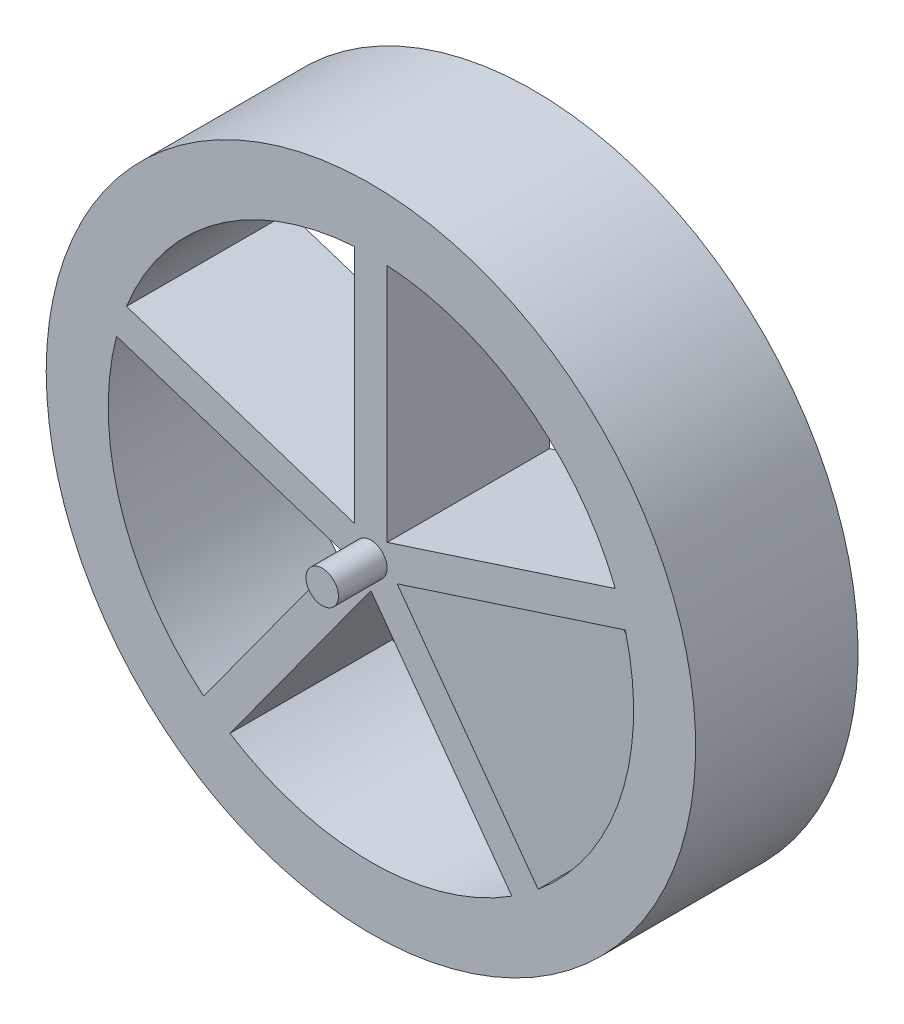
ISO-10303-21;
HEADER;
FILE_DESCRIPTION(('STEP AP214'),'2;1');
FILE_NAME('part.step','',(''),(''),'','','');
FILE_SCHEMA(('AUTOMOTIVE_DESIGN { 1 0 10303 214 1 1 1 1 }'));
ENDSEC;
DATA;
#1=APPLICATION_CONTEXT('core data for automotive mechanical design processes');
#2=APPLICATION_PROTOCOL_DEFINITION('international standard','automotive_design',2000,#1);
#3=PRODUCT_CONTEXT('',#1,'mechanical');
#4=PRODUCT('Part','Part','',(#3));
#5=PRODUCT_RELATED_PRODUCT_CATEGORY('part','',(#4));
#6=PRODUCT_DEFINITION_FORMATION('','',#4);
#7=PRODUCT_DEFINITION_CONTEXT('part definition',#1,'design');
#8=PRODUCT_DEFINITION('design','',#6,#7);
#9=PRODUCT_DEFINITION_SHAPE('','',#8);
#10=(LENGTH_UNIT() NAMED_UNIT(*) SI_UNIT(.MILLI.,.METRE.));
#11=(NAMED_UNIT(*) PLANE_ANGLE_UNIT() SI_UNIT($,.RADIAN.));
#12=(NAMED_UNIT(*) SI_UNIT($,.STERADIAN.) SOLID_ANGLE_UNIT());
#13=UNCERTAINTY_MEASURE_WITH_UNIT(LENGTH_MEASURE(1.E-05),#10,'distance_accuracy_value','');
#14=(GEOMETRIC_REPRESENTATION_CONTEXT(3) GLOBAL_UNCERTAINTY_ASSIGNED_CONTEXT((#13)) GLOBAL_UNIT_ASSIGNED_CONTEXT((#10,
#11,#12)) REPRESENTATION_CONTEXT('',''));
#15=CARTESIAN_POINT('',(0.,0.,0.));
#16=DIRECTION('',(0.,0.,1.));
#17=DIRECTION('',(1.,0.,0.));
#18=AXIS2_PLACEMENT_3D('',#15,#16,#17);
#19=CARTESIAN_POINT('',(0.,0.,40.));
#20=DIRECTION('',(0.,0.,1.));
#21=DIRECTION('',(1.,0.,0.));
#22=AXIS2_PLACEMENT_3D('',#19,#20,#21);
#23=PLANE('',#22);
#24=CARTESIAN_POINT('',(0.,0.,40.));
#25=DIRECTION('',(0.,0.,-1.));
#26=DIRECTION('',(-1.,0.,0.));
#27=AXIS2_PLACEMENT_3D('',#24,#25,#26);
#28=CIRCLE('',#27,5.);
#29=CARTESIAN_POINT('',(-5.,0.,40.));
#30=VERTEX_POINT('',#29);
#31=EDGE_CURVE('E20',#30,#30,#28,.T.);
#32=ORIENTED_EDGE('',*,*,#31,.F.);
#33=EDGE_LOOP('',(#32));
#34=FACE_BOUND('',#33,.T.);
#35=ADVANCED_FACE('F17',(#34),#23,.T.);
#36=CARTESIAN_POINT('',(0.,0.,40.));
#37=DIRECTION('',(0.,0.,-1.));
#38=DIRECTION('',(-1.,0.,0.));
#39=AXIS2_PLACEMENT_3D('',#36,#37,#38);
#40=CYLINDRICAL_SURFACE('',#39,5.);
#41=ORIENTED_EDGE('',*,*,#31,.T.);
#42=EDGE_LOOP('',(#41));
#43=FACE_BOUND('',#42,.T.);
#44=CARTESIAN_POINT('',(0.,0.,25.));
#45=DIRECTION('',(0.,0.,-1.));
#46=DIRECTION('',(-1.,0.,0.));
#47=AXIS2_PLACEMENT_3D('',#44,#45,#46);
#48=CIRCLE('',#47,5.);
#49=CARTESIAN_POINT('',(-5.,0.,25.));
#50=VERTEX_POINT('',#49);
#51=EDGE_CURVE('E158',#50,#50,#48,.T.);
#52=ORIENTED_EDGE('',*,*,#51,.F.);
#53=EDGE_LOOP('',(#52));
#54=FACE_BOUND('',#53,.T.);
#55=ADVANCED_FACE('F379',(#43,#54),#40,.T.);
#56=CARTESIAN_POINT('',(35.9753398201831,-41.0191694885095,25.));
#57=DIRECTION('',(0.809016994374947,0.587785252292474,0.));
#58=DIRECTION('',(-0.587785252292474,0.809016994374947,0.));
#59=AXIS2_PLACEMENT_3D('',#56,#57,#58);
#60=PLANE('',#59);
#61=DIRECTION('',(-0.587785252292473,0.809016994374947,0.));
#62=VECTOR('',#61,1.);
#63=CARTESIAN_POINT('',(51.5025235293377,-62.3905044216244,-25.));
#64=LINE('',#63,#62);
#65=CARTESIAN_POINT('',(51.5025235293377,-62.3905044216244,-25.));
#66=VERTEX_POINT('',#65);
#67=CARTESIAN_POINT('',(8.08436835006003,-2.63054061265489,-25.));
#68=VERTEX_POINT('',#67);
#69=EDGE_CURVE('E161',#66,#68,#64,.T.);
#70=ORIENTED_EDGE('',*,*,#69,.T.);
#71=DIRECTION('',(0.,0.,1.));
#72=VECTOR('',#71,1.);
#73=CARTESIAN_POINT('',(8.08436835006002,-2.63054061265489,25.));
#74=LINE('',#73,#72);
#75=CARTESIAN_POINT('',(8.08436835006002,-2.63054061265488,25.));
#76=VERTEX_POINT('',#75);
#77=EDGE_CURVE('E112',#76,#68,#74,.F.);
#78=ORIENTED_EDGE('',*,*,#77,.F.);
#79=DIRECTION('',(-0.587785252292473,0.809016994374948,0.));
#80=VECTOR('',#79,1.);
#81=CARTESIAN_POINT('',(51.5025235293376,-62.3905044216245,25.));
#82=LINE('',#81,#80);
#83=CARTESIAN_POINT('',(51.5025235293377,-62.3905044216245,25.));
#84=VERTEX_POINT('',#83);
#85=EDGE_CURVE('E114',#84,#76,#82,.T.);
#86=ORIENTED_EDGE('',*,*,#85,.F.);
#87=DIRECTION('',(0.,0.,-1.));
#88=VECTOR('',#87,1.);
#89=CARTESIAN_POINT('',(51.5025235293377,-62.3905044216244,25.));
#90=LINE('',#89,#88);
#91=EDGE_CURVE('E117',#84,#66,#90,.T.);
#92=ORIENTED_EDGE('',*,*,#91,.T.);
#93=EDGE_LOOP('',(#70,#78,#86,#92));
#94=FACE_BOUND('',#93,.T.);
#95=ADVANCED_FACE('F116',(#94),#60,.T.);
#96=CARTESIAN_POINT('',(23.9130078857885,2.51249613707417,25.));
#97=DIRECTION('',(0.309016994374948,-0.951056516295154,0.));
#98=DIRECTION('',(0.951056516295154,0.309016994374948,0.));
#99=AXIS2_PLACEMENT_3D('',#96,#97,#98);
#100=PLANE('',#99);
#101=DIRECTION('',(0.951056516295153,0.309016994374949,0.));
#102=VECTOR('',#101,1.);
#103=CARTESIAN_POINT('',(8.08436835006002,-2.63054061265488,-25.));
#104=LINE('',#103,#102);
#105=CARTESIAN_POINT('',(78.340086498309,20.196925986699,-25.));
#106=VERTEX_POINT('',#105);
#107=EDGE_CURVE('E164',#68,#106,#104,.T.);
#108=ORIENTED_EDGE('',*,*,#107,.T.);
#109=DIRECTION('',(0.,0.,-1.));
#110=VECTOR('',#109,1.);
#111=CARTESIAN_POINT('',(78.340086498309,20.196925986699,25.));
#112=LINE('',#111,#110);
#113=CARTESIAN_POINT('',(78.340086498309,20.196925986699,25.));
#114=VERTEX_POINT('',#113);
#115=EDGE_CURVE('E105',#106,#114,#112,.F.);
#116=ORIENTED_EDGE('',*,*,#115,.T.);
#117=DIRECTION('',(0.951056516295153,0.309016994374949,0.));
#118=VECTOR('',#117,1.);
#119=CARTESIAN_POINT('',(8.08436835006003,-2.63054061265488,25.));
#120=LINE('',#119,#118);
#121=EDGE_CURVE('E122',#76,#114,#120,.T.);
#122=ORIENTED_EDGE('',*,*,#121,.F.);
#123=ORIENTED_EDGE('',*,*,#77,.T.);
#124=EDGE_LOOP('',(#108,#116,#122,#123));
#125=FACE_BOUND('',#124,.T.);
#126=ADVANCED_FACE('F318',(#125),#100,.T.);
#127=CARTESIAN_POINT('',(3.41264393947058E-13,0.,25.));
#128=DIRECTION('',(0.,0.,-1.));
#129=DIRECTION('',(-1.,0.,0.));
#130=AXIS2_PLACEMENT_3D('',#127,#128,#129);
#131=CYLINDRICAL_SURFACE('',#130,80.9016994374944);
#132=CARTESIAN_POINT('',(3.41264393947058E-13,0.,25.));
#133=DIRECTION('',(0.,0.,-1.));
#134=DIRECTION('',(-1.,0.,0.));
#135=AXIS2_PLACEMENT_3D('',#132,#133,#134);
#136=CIRCLE('',#135,80.9016994374944);
#137=EDGE_CURVE('E127',#114,#84,#136,.T.);
#138=ORIENTED_EDGE('',*,*,#137,.F.);
#139=ORIENTED_EDGE('',*,*,#115,.F.);
#140=CARTESIAN_POINT('',(3.41264393947058E-13,0.,-25.));
#141=DIRECTION('',(0.,0.,-1.));
#142=DIRECTION('',(-1.,0.,0.));
#143=AXIS2_PLACEMENT_3D('',#140,#141,#142);
#144=CIRCLE('',#143,80.9016994374944);
#145=EDGE_CURVE('E129',#106,#66,#144,.T.);
#146=ORIENTED_EDGE('',*,*,#145,.T.);
#147=ORIENTED_EDGE('',*,*,#91,.F.);
#148=EDGE_LOOP('',(#138,#139,#146,#147));
#149=FACE_BOUND('',#148,.T.);
#150=ADVANCED_FACE('F126',(#149),#131,.F.);
#151=CARTESIAN_POINT('',(-5.00000000000005,55.5819738354776,25.));
#152=DIRECTION('',(-1.,0.,0.));
#153=DIRECTION('',(0.,-1.,0.));
#154=AXIS2_PLACEMENT_3D('',#151,#152,#153);
#155=PLANE('',#154);
#156=DIRECTION('',(0.,1.,0.));
#157=VECTOR('',#156,1.);
#158=CARTESIAN_POINT('',(-5.00000000000005,0.,-25.));
#159=LINE('',#158,#157);
#160=CARTESIAN_POINT('',(-5.00000000000007,80.7470431153658,-25.));
#161=VERTEX_POINT('',#160);
#162=CARTESIAN_POINT('',(-5.00000000000007,6.88190960235584,-25.));
#163=VERTEX_POINT('',#162);
#164=EDGE_CURVE('E163',#161,#163,#159,.F.);
#165=ORIENTED_EDGE('',*,*,#164,.T.);
#166=DIRECTION('',(0.,0.,1.));
#167=VECTOR('',#166,1.);
#168=CARTESIAN_POINT('',(-5.0000000000001,6.88190960235586,25.));
#169=LINE('',#168,#167);
#170=CARTESIAN_POINT('',(-5.00000000000009,6.88190960235585,25.));
#171=VERTEX_POINT('',#170);
#172=EDGE_CURVE('E131',#171,#163,#169,.F.);
#173=ORIENTED_EDGE('',*,*,#172,.F.);
#174=DIRECTION('',(0.,1.,0.));
#175=VECTOR('',#174,1.);
#176=CARTESIAN_POINT('',(-5.00000000000009,0.,25.));
#177=LINE('',#176,#175);
#178=CARTESIAN_POINT('',(-5.00000000000009,80.7470431153658,25.));
#179=VERTEX_POINT('',#178);
#180=EDGE_CURVE('E143',#179,#171,#177,.F.);
#181=ORIENTED_EDGE('',*,*,#180,.F.);
#182=DIRECTION('',(0.,0.,-1.));
#183=VECTOR('',#182,1.);
#184=CARTESIAN_POINT('',(-5.0000000000001,80.7470431153658,25.));
#185=LINE('',#184,#183);
#186=EDGE_CURVE('E191',#179,#161,#185,.T.);
#187=ORIENTED_EDGE('',*,*,#186,.T.);
#188=EDGE_LOOP('',(#165,#173,#181,#187));
#189=FACE_BOUND('',#188,.T.);
#190=ADVANCED_FACE('F369',(#189),#155,.T.);
#191=CARTESIAN_POINT('',(-17.7704285840007,11.0312733786334,25.));
#192=DIRECTION('',(0.309016994374947,0.951056516295154,0.));
#193=DIRECTION('',(-0.951056516295154,0.309016994374947,0.));
#194=AXIS2_PLACEMENT_3D('',#191,#192,#193);
#195=PLANE('',#194);
#196=DIRECTION('',(-0.951056516295154,0.309016994374948,0.));
#197=VECTOR('',#196,1.);
#198=CARTESIAN_POINT('',(-5.00000000000005,6.88190960235583,-25.));
#199=LINE('',#198,#197);
#200=CARTESIAN_POINT('',(-75.2499165545596,29.7074911496503,-25.));
#201=VERTEX_POINT('',#200);
#202=EDGE_CURVE('E169',#163,#201,#199,.T.);
#203=ORIENTED_EDGE('',*,*,#202,.T.);
#204=DIRECTION('',(0.,0.,-1.));
#205=VECTOR('',#204,1.);
#206=CARTESIAN_POINT('',(-75.2499165545596,29.7074911496503,25.));
#207=LINE('',#206,#205);
#208=CARTESIAN_POINT('',(-75.2499165545596,29.7074911496504,25.));
#209=VERTEX_POINT('',#208);
#210=EDGE_CURVE('E192',#201,#209,#207,.F.);
#211=ORIENTED_EDGE('',*,*,#210,.T.);
#212=DIRECTION('',(-0.951056516295154,0.309016994374948,0.));
#213=VECTOR('',#212,1.);
#214=CARTESIAN_POINT('',(-5.0000000000001,6.88190960235585,25.));
#215=LINE('',#214,#213);
#216=EDGE_CURVE('E148',#171,#209,#215,.T.);
#217=ORIENTED_EDGE('',*,*,#216,.F.);
#218=ORIENTED_EDGE('',*,*,#172,.T.);
#219=EDGE_LOOP('',(#203,#211,#217,#218));
#220=FACE_BOUND('',#219,.T.);
#221=ADVANCED_FACE('F365',(#220),#195,.T.);
#222=CARTESIAN_POINT('',(0.,0.,25.));
#223=DIRECTION('',(0.,0.,-1.));
#224=DIRECTION('',(-1.,0.,0.));
#225=AXIS2_PLACEMENT_3D('',#222,#223,#224);
#226=CYLINDRICAL_SURFACE('',#225,80.9016994374948);
#227=ORIENTED_EDGE('',*,*,#210,.F.);
#228=CARTESIAN_POINT('',(0.,0.,-25.));
#229=DIRECTION('',(0.,0.,-1.));
#230=DIRECTION('',(-1.,0.,0.));
#231=AXIS2_PLACEMENT_3D('',#228,#229,#230);
#232=CIRCLE('',#231,80.9016994374948);
#233=EDGE_CURVE('E165',#201,#161,#232,.T.);
#234=ORIENTED_EDGE('',*,*,#233,.T.);
#235=ORIENTED_EDGE('',*,*,#186,.F.);
#236=CARTESIAN_POINT('',(0.,0.,25.));
#237=DIRECTION('',(0.,0.,-1.));
#238=DIRECTION('',(-1.,0.,0.));
#239=AXIS2_PLACEMENT_3D('',#236,#237,#238);
#240=CIRCLE('',#239,80.9016994374948);
#241=EDGE_CURVE('E144',#209,#179,#240,.T.);
#242=ORIENTED_EDGE('',*,*,#241,.F.);
#243=EDGE_LOOP('',(#227,#234,#235,#242));
#244=FACE_BOUND('',#243,.T.);
#245=ADVANCED_FACE('F361',(#244),#226,.F.);
#246=CARTESIAN_POINT('',(-20.7622587651239,-20.0702895089404,25.));
#247=DIRECTION('',(-0.809016994374948,0.587785252292473,0.));
#248=DIRECTION('',(-0.587785252292473,-0.809016994374948,0.));
#249=AXIS2_PLACEMENT_3D('',#246,#247,#248);
#250=PLANE('',#249);
#251=DIRECTION('',(-0.587785252292473,-0.809016994374948,0.));
#252=VECTOR('',#251,1.);
#253=CARTESIAN_POINT('',(-8.09016994374947,-2.62865556059569,-25.));
#254=LINE('',#253,#252);
#255=CARTESIAN_POINT('',(-8.09016994374947,-2.62865556059569,-25.));
#256=VERTEX_POINT('',#255);
#257=CARTESIAN_POINT('',(-51.5070060813112,-62.3868038643952,-25.));
#258=VERTEX_POINT('',#257);
#259=EDGE_CURVE('E168',#256,#258,#254,.T.);
#260=ORIENTED_EDGE('',*,*,#259,.T.);
#261=DIRECTION('',(0.,0.,-1.));
#262=VECTOR('',#261,1.);
#263=CARTESIAN_POINT('',(-51.5070060813112,-62.3868038643952,25.));
#264=LINE('',#263,#262);
#265=CARTESIAN_POINT('',(-51.5070060813112,-62.3868038643952,25.));
#266=VERTEX_POINT('',#265);
#267=EDGE_CURVE('E194',#258,#266,#264,.F.);
#268=ORIENTED_EDGE('',*,*,#267,.T.);
#269=DIRECTION('',(-0.587785252292473,-0.809016994374948,0.));
#270=VECTOR('',#269,1.);
#271=CARTESIAN_POINT('',(-8.09016994374947,-2.62865556059569,25.));
#272=LINE('',#271,#270);
#273=CARTESIAN_POINT('',(-8.09016994374947,-2.62865556059569,25.));
#274=VERTEX_POINT('',#273);
#275=EDGE_CURVE('E152',#274,#266,#272,.T.);
#276=ORIENTED_EDGE('',*,*,#275,.F.);
#277=DIRECTION('',(0.,0.,1.));
#278=VECTOR('',#277,1.);
#279=CARTESIAN_POINT('',(-8.09016994374947,-2.6286555605957,25.));
#280=LINE('',#279,#278);
#281=EDGE_CURVE('E201',#256,#274,#280,.T.);
#282=ORIENTED_EDGE('',*,*,#281,.F.);
#283=EDGE_LOOP('',(#260,#268,#276,#282));
#284=FACE_BOUND('',#283,.T.);
#285=ADVANCED_FACE('F357',(#284),#250,.T.);
#286=CARTESIAN_POINT('',(-1.62620776849758E-13,0.,25.));
#287=DIRECTION('',(0.,0.,-1.));
#288=DIRECTION('',(-1.,0.,0.));
#289=AXIS2_PLACEMENT_3D('',#286,#287,#288);
#290=CYLINDRICAL_SURFACE('',#289,80.9016994374946);
#291=CARTESIAN_POINT('',(-1.62620776849758E-13,0.,25.));
#292=DIRECTION('',(0.,0.,-1.));
#293=DIRECTION('',(-1.,0.,0.));
#294=AXIS2_PLACEMENT_3D('',#291,#292,#293);
#295=CIRCLE('',#294,80.9016994374946);
#296=CARTESIAN_POINT('',(-78.3400864983091,20.1969259866988,25.));
#297=VERTEX_POINT('',#296);
#298=EDGE_CURVE('E154',#266,#297,#295,.T.);
#299=ORIENTED_EDGE('',*,*,#298,.F.);
#300=ORIENTED_EDGE('',*,*,#267,.F.);
#301=CARTESIAN_POINT('',(-1.62620776849758E-13,0.,-25.));
#302=DIRECTION('',(0.,0.,-1.));
#303=DIRECTION('',(-1.,0.,0.));
#304=AXIS2_PLACEMENT_3D('',#301,#302,#303);
#305=CIRCLE('',#304,80.9016994374946);
#306=CARTESIAN_POINT('',(-78.3400864983091,20.1969259866988,-25.));
#307=VERTEX_POINT('',#306);
#308=EDGE_CURVE('E170',#258,#307,#305,.T.);
#309=ORIENTED_EDGE('',*,*,#308,.T.);
#310=DIRECTION('',(0.,0.,1.));
#311=VECTOR('',#310,1.);
#312=CARTESIAN_POINT('',(-78.3400864983091,20.1969259866988,25.));
#313=LINE('',#312,#311);
#314=EDGE_CURVE('E198',#297,#307,#313,.F.);
#315=ORIENTED_EDGE('',*,*,#314,.F.);
#316=EDGE_LOOP('',(#299,#300,#309,#315));
#317=FACE_BOUND('',#316,.T.);
#318=ADVANCED_FACE('F353',(#317),#290,.F.);
#319=CARTESIAN_POINT('',(-52.9539113546902,11.9484576705188,25.));
#320=DIRECTION('',(-0.309016994374947,-0.951056516295154,0.));
#321=DIRECTION('',(0.951056516295154,-0.309016994374947,0.));
#322=AXIS2_PLACEMENT_3D('',#319,#320,#321);
#323=PLANE('',#322);
#324=DIRECTION('',(0.951056516295154,-0.309016994374947,0.));
#325=VECTOR('',#324,1.);
#326=CARTESIAN_POINT('',(-78.3400864983091,20.1969259866988,-25.));
#327=LINE('',#326,#325);
#328=EDGE_CURVE('E172',#307,#256,#327,.T.);
#329=ORIENTED_EDGE('',*,*,#328,.T.);
#330=ORIENTED_EDGE('',*,*,#281,.T.);
#331=DIRECTION('',(0.951056516295154,-0.309016994374947,0.));
#332=VECTOR('',#331,1.);
#333=CARTESIAN_POINT('',(-78.3400864983091,20.1969259866988,25.));
#334=LINE('',#333,#332);
#335=EDGE_CURVE('E157',#297,#274,#334,.T.);
#336=ORIENTED_EDGE('',*,*,#335,.F.);
#337=ORIENTED_EDGE('',*,*,#314,.T.);
#338=EDGE_LOOP('',(#329,#330,#336,#337));
#339=FACE_BOUND('',#338,.T.);
#340=ADVANCED_FACE('F349',(#339),#323,.T.);
#341=CARTESIAN_POINT('',(55.9506970161635,23.4367945997026,25.));
#342=DIRECTION('',(-0.309016994374948,0.951056516295154,0.));
#343=DIRECTION('',(-0.951056516295154,-0.309016994374948,0.));
#344=AXIS2_PLACEMENT_3D('',#341,#342,#343);
#345=PLANE('',#344);
#346=DIRECTION('',(-0.951056516295153,-0.309016994374948,0.));
#347=VECTOR('',#346,1.);
#348=CARTESIAN_POINT('',(75.2499165545596,29.7074911496505,-25.));
#349=LINE('',#348,#347);
#350=CARTESIAN_POINT('',(75.2499165545595,29.7074911496504,-25.));
#351=VERTEX_POINT('',#350);
#352=CARTESIAN_POINT('',(5.,6.88190960235588,-25.));
#353=VERTEX_POINT('',#352);
#354=EDGE_CURVE('E277',#351,#353,#349,.T.);
#355=ORIENTED_EDGE('',*,*,#354,.T.);
#356=DIRECTION('',(0.,0.,1.));
#357=VECTOR('',#356,1.);
#358=CARTESIAN_POINT('',(4.99999999999999,6.88190960235588,25.));
#359=LINE('',#358,#357);
#360=CARTESIAN_POINT('',(5.,6.88190960235588,25.));
#361=VERTEX_POINT('',#360);
#362=EDGE_CURVE('E204',#361,#353,#359,.F.);
#363=ORIENTED_EDGE('',*,*,#362,.F.);
#364=DIRECTION('',(-0.951056516295153,-0.309016994374948,0.));
#365=VECTOR('',#364,1.);
#366=CARTESIAN_POINT('',(75.2499165545596,29.7074911496505,25.));
#367=LINE('',#366,#365);
#368=CARTESIAN_POINT('',(75.2499165545595,29.7074911496504,25.));
#369=VERTEX_POINT('',#368);
#370=EDGE_CURVE('E147',#369,#361,#367,.T.);
#371=ORIENTED_EDGE('',*,*,#370,.F.);
#372=DIRECTION('',(0.,0.,-1.));
#373=VECTOR('',#372,1.);
#374=CARTESIAN_POINT('',(75.2499165545595,29.7074911496504,25.));
#375=LINE('',#374,#373);
#376=EDGE_CURVE('E213',#369,#351,#375,.T.);
#377=ORIENTED_EDGE('',*,*,#376,.T.);
#378=EDGE_LOOP('',(#355,#363,#371,#377));
#379=FACE_BOUND('',#378,.T.);
#380=ADVANCED_FACE('F345',(#379),#345,.T.);
#381=CARTESIAN_POINT('',(4.99999999999999,7.7210084481961,25.));
#382=DIRECTION('',(1.,0.,0.));
#383=DIRECTION('',(0.,1.,0.));
#384=AXIS2_PLACEMENT_3D('',#381,#382,#383);
#385=PLANE('',#384);
#386=DIRECTION('',(0.,1.,0.));
#387=VECTOR('',#386,1.);
#388=CARTESIAN_POINT('',(5.,0.,-25.));
#389=LINE('',#388,#387);
#390=CARTESIAN_POINT('',(4.99999999999997,80.7470431153658,-25.));
#391=VERTEX_POINT('',#390);
#392=EDGE_CURVE('E177',#353,#391,#389,.T.);
#393=ORIENTED_EDGE('',*,*,#392,.T.);
#394=DIRECTION('',(0.,0.,-1.));
#395=VECTOR('',#394,1.);
#396=CARTESIAN_POINT('',(4.99999999999994,80.7470431153658,25.));
#397=LINE('',#396,#395);
#398=CARTESIAN_POINT('',(4.99999999999997,80.7470431153658,25.));
#399=VERTEX_POINT('',#398);
#400=EDGE_CURVE('E211',#391,#399,#397,.F.);
#401=ORIENTED_EDGE('',*,*,#400,.T.);
#402=DIRECTION('',(0.,1.,0.));
#403=VECTOR('',#402,1.);
#404=CARTESIAN_POINT('',(5.,0.,25.));
#405=LINE('',#404,#403);
#406=EDGE_CURVE('E153',#361,#399,#405,.T.);
#407=ORIENTED_EDGE('',*,*,#406,.F.);
#408=ORIENTED_EDGE('',*,*,#362,.T.);
#409=EDGE_LOOP('',(#393,#401,#407,#408));
#410=FACE_BOUND('',#409,.T.);
#411=ADVANCED_FACE('F341',(#410),#385,.T.);
#412=CARTESIAN_POINT('',(0.,1.66852742180411E-13,25.));
#413=DIRECTION('',(0.,0.,-1.));
#414=DIRECTION('',(-1.,0.,0.));
#415=AXIS2_PLACEMENT_3D('',#412,#413,#414);
#416=CYLINDRICAL_SURFACE('',#415,80.9016994374946);
#417=CARTESIAN_POINT('',(0.,1.66852742180411E-13,25.));
#418=DIRECTION('',(0.,0.,-1.));
#419=DIRECTION('',(-1.,0.,0.));
#420=AXIS2_PLACEMENT_3D('',#417,#418,#419);
#421=CIRCLE('',#420,80.9016994374946);
#422=EDGE_CURVE('E149',#399,#369,#421,.T.);
#423=ORIENTED_EDGE('',*,*,#422,.F.);
#424=ORIENTED_EDGE('',*,*,#400,.F.);
#425=CARTESIAN_POINT('',(0.,1.66852742180411E-13,-25.));
#426=DIRECTION('',(0.,0.,-1.));
#427=DIRECTION('',(-1.,0.,0.));
#428=AXIS2_PLACEMENT_3D('',#425,#426,#427);
#429=CIRCLE('',#428,80.9016994374946);
#430=EDGE_CURVE('E173',#391,#351,#429,.T.);
#431=ORIENTED_EDGE('',*,*,#430,.T.);
#432=ORIENTED_EDGE('',*,*,#376,.F.);
#433=EDGE_LOOP('',(#423,#424,#431,#432));
#434=FACE_BOUND('',#433,.T.);
#435=ADVANCED_FACE('F338',(#434),#416,.F.);
#436=CARTESIAN_POINT('',(-34.3805068901553,-55.8272161837648,25.));
#437=DIRECTION('',(0.809016994374948,-0.587785252292473,0.));
#438=DIRECTION('',(0.587785252292473,0.809016994374948,0.));
#439=AXIS2_PLACEMENT_3D('',#436,#437,#438);
#440=PLANE('',#439);
#441=DIRECTION('',(0.587785252292473,0.809016994374948,0.));
#442=VECTOR('',#441,1.);
#443=CARTESIAN_POINT('',(-43.4168361375617,-68.2646563873198,-25.));
#444=LINE('',#443,#442);
#445=CARTESIAN_POINT('',(-43.4168361375617,-68.2646563873198,-25.));
#446=VERTEX_POINT('',#445);
#447=CARTESIAN_POINT('',(0.,-8.50650808352036,-25.));
#448=VERTEX_POINT('',#447);
#449=EDGE_CURVE('E176',#446,#448,#444,.T.);
#450=ORIENTED_EDGE('',*,*,#449,.T.);
#451=DIRECTION('',(0.,0.,1.));
#452=VECTOR('',#451,1.);
#453=CARTESIAN_POINT('',(0.,-8.50650808352037,25.));
#454=LINE('',#453,#452);
#455=CARTESIAN_POINT('',(0.,-8.50650808352035,25.));
#456=VERTEX_POINT('',#455);
#457=EDGE_CURVE('E215',#456,#448,#454,.F.);
#458=ORIENTED_EDGE('',*,*,#457,.F.);
#459=DIRECTION('',(0.587785252292473,0.809016994374948,0.));
#460=VECTOR('',#459,1.);
#461=CARTESIAN_POINT('',(-43.4168361375617,-68.2646563873198,25.));
#462=LINE('',#461,#460);
#463=CARTESIAN_POINT('',(-43.4168361375617,-68.2646563873198,25.));
#464=VERTEX_POINT('',#463);
#465=EDGE_CURVE('E134',#464,#456,#462,.T.);
#466=ORIENTED_EDGE('',*,*,#465,.F.);
#467=DIRECTION('',(0.,0.,-1.));
#468=VECTOR('',#467,1.);
#469=CARTESIAN_POINT('',(-43.4168361375617,-68.2646563873199,25.));
#470=LINE('',#469,#468);
#471=EDGE_CURVE('E123',#464,#446,#470,.T.);
#472=ORIENTED_EDGE('',*,*,#471,.T.);
#473=EDGE_LOOP('',(#450,#458,#466,#472));
#474=FACE_BOUND('',#473,.T.);
#475=ADVANCED_FACE('F293',(#474),#440,.T.);
#476=CARTESIAN_POINT('',(6.25210778080068,-17.1117961978515,25.));
#477=DIRECTION('',(-0.809016994374947,-0.587785252292474,0.));
#478=DIRECTION('',(0.587785252292474,-0.809016994374947,0.));
#479=AXIS2_PLACEMENT_3D('',#476,#477,#478);
#480=PLANE('',#479);
#481=DIRECTION('',(0.587785252292473,-0.809016994374948,0.));
#482=VECTOR('',#481,1.);
#483=CARTESIAN_POINT('',(0.,-8.50650808352036,-25.));
#484=LINE('',#483,#482);
#485=CARTESIAN_POINT('',(43.4168361375617,-68.2646563873199,-25.));
#486=VERTEX_POINT('',#485);
#487=EDGE_CURVE('E35',#448,#486,#484,.T.);
#488=ORIENTED_EDGE('',*,*,#487,.T.);
#489=DIRECTION('',(0.,0.,-1.));
#490=VECTOR('',#489,1.);
#491=CARTESIAN_POINT('',(43.4168361375617,-68.2646563873199,25.));
#492=LINE('',#491,#490);
#493=CARTESIAN_POINT('',(43.4168361375617,-68.2646563873199,25.));
#494=VERTEX_POINT('',#493);
#495=EDGE_CURVE('E219',#486,#494,#492,.F.);
#496=ORIENTED_EDGE('',*,*,#495,.T.);
#497=DIRECTION('',(0.587785252292473,-0.809016994374948,0.));
#498=VECTOR('',#497,1.);
#499=CARTESIAN_POINT('',(0.,-8.50650808352036,25.));
#500=LINE('',#499,#498);
#501=EDGE_CURVE('E136',#456,#494,#500,.T.);
#502=ORIENTED_EDGE('',*,*,#501,.F.);
#503=ORIENTED_EDGE('',*,*,#457,.T.);
#504=EDGE_LOOP('',(#488,#496,#502,#503));
#505=FACE_BOUND('',#504,.T.);
#506=ADVANCED_FACE('F298',(#505),#480,.T.);
#507=CARTESIAN_POINT('',(0.,-2.75489079514466E-13,25.));
#508=DIRECTION('',(0.,0.,-1.));
#509=DIRECTION('',(-1.,0.,0.));
#510=AXIS2_PLACEMENT_3D('',#507,#508,#509);
#511=CYLINDRICAL_SURFACE('',#510,80.9016994374945);
#512=CARTESIAN_POINT('',(0.,-2.75489079514466E-13,25.));
#513=DIRECTION('',(0.,0.,-1.));
#514=DIRECTION('',(-1.,0.,0.));
#515=AXIS2_PLACEMENT_3D('',#512,#513,#514);
#516=CIRCLE('',#515,80.9016994374945);
#517=EDGE_CURVE('E140',#494,#464,#516,.T.);
#518=ORIENTED_EDGE('',*,*,#517,.F.);
#519=ORIENTED_EDGE('',*,*,#495,.F.);
#520=CARTESIAN_POINT('',(0.,-2.75489079514466E-13,-25.));
#521=DIRECTION('',(0.,0.,-1.));
#522=DIRECTION('',(-1.,0.,0.));
#523=AXIS2_PLACEMENT_3D('',#520,#521,#522);
#524=CIRCLE('',#523,80.9016994374945);
#525=EDGE_CURVE('E178',#486,#446,#524,.T.);
#526=ORIENTED_EDGE('',*,*,#525,.T.);
#527=ORIENTED_EDGE('',*,*,#471,.F.);
#528=EDGE_LOOP('',(#518,#519,#526,#527));
#529=FACE_BOUND('',#528,.T.);
#530=ADVANCED_FACE('F303',(#529),#511,.F.);
#531=CARTESIAN_POINT('',(0.,0.,25.));
#532=DIRECTION('',(0.,0.,1.));
#533=DIRECTION('',(1.,0.,0.));
#534=AXIS2_PLACEMENT_3D('',#531,#532,#533);
#535=PLANE('',#534);
#536=ORIENTED_EDGE('',*,*,#51,.T.);
#537=EDGE_LOOP('',(#536));
#538=FACE_BOUND('',#537,.T.);
#539=CARTESIAN_POINT('',(0.,0.,25.));
#540=DIRECTION('',(0.,0.,-1.));
#541=DIRECTION('',(-1.,0.,0.));
#542=AXIS2_PLACEMENT_3D('',#539,#540,#541);
#543=CIRCLE('',#542,100.);
#544=CARTESIAN_POINT('',(-100.,0.,25.));
#545=VERTEX_POINT('',#544);
#546=EDGE_CURVE('E26',#545,#545,#543,.T.);
#547=ORIENTED_EDGE('',*,*,#546,.F.);
#548=EDGE_LOOP('',(#547));
#549=FACE_BOUND('',#548,.T.);
#550=ORIENTED_EDGE('',*,*,#298,.T.);
#551=ORIENTED_EDGE('',*,*,#335,.T.);
#552=ORIENTED_EDGE('',*,*,#275,.T.);
#553=EDGE_LOOP('',(#550,#551,#552));
#554=FACE_BOUND('',#553,.T.);
#555=ORIENTED_EDGE('',*,*,#406,.T.);
#556=ORIENTED_EDGE('',*,*,#422,.T.);
#557=ORIENTED_EDGE('',*,*,#370,.T.);
#558=EDGE_LOOP('',(#555,#556,#557));
#559=FACE_BOUND('',#558,.T.);
#560=ORIENTED_EDGE('',*,*,#216,.T.);
#561=ORIENTED_EDGE('',*,*,#241,.T.);
#562=ORIENTED_EDGE('',*,*,#180,.T.);
#563=EDGE_LOOP('',(#560,#561,#562));
#564=FACE_BOUND('',#563,.T.);
#565=ORIENTED_EDGE('',*,*,#501,.T.);
#566=ORIENTED_EDGE('',*,*,#517,.T.);
#567=ORIENTED_EDGE('',*,*,#465,.T.);
#568=EDGE_LOOP('',(#565,#566,#567));
#569=FACE_BOUND('',#568,.T.);
#570=ORIENTED_EDGE('',*,*,#121,.T.);
#571=ORIENTED_EDGE('',*,*,#137,.T.);
#572=ORIENTED_EDGE('',*,*,#85,.T.);
#573=EDGE_LOOP('',(#570,#571,#572));
#574=FACE_BOUND('',#573,.T.);
#575=ADVANCED_FACE('F133',(#538,#549,#554,#559,#564,#569,#574),#535,.T.);
#576=CARTESIAN_POINT('',(0.,0.,-25.));
#577=DIRECTION('',(0.,0.,1.));
#578=DIRECTION('',(1.,0.,0.));
#579=AXIS2_PLACEMENT_3D('',#576,#577,#578);
#580=PLANE('',#579);
#581=ORIENTED_EDGE('',*,*,#487,.F.);
#582=ORIENTED_EDGE('',*,*,#449,.F.);
#583=ORIENTED_EDGE('',*,*,#525,.F.);
#584=EDGE_LOOP('',(#581,#582,#583));
#585=FACE_BOUND('',#584,.T.);
#586=ORIENTED_EDGE('',*,*,#392,.F.);
#587=ORIENTED_EDGE('',*,*,#354,.F.);
#588=ORIENTED_EDGE('',*,*,#430,.F.);
#589=EDGE_LOOP('',(#586,#587,#588));
#590=FACE_BOUND('',#589,.T.);
#591=CARTESIAN_POINT('',(0.,0.,-25.));
#592=DIRECTION('',(0.,0.,-1.));
#593=DIRECTION('',(-1.,0.,0.));
#594=AXIS2_PLACEMENT_3D('',#591,#592,#593);
#595=CIRCLE('',#594,100.);
#596=CARTESIAN_POINT('',(-100.,0.,-25.));
#597=VERTEX_POINT('',#596);
#598=EDGE_CURVE('E10',#597,#597,#595,.F.);
#599=ORIENTED_EDGE('',*,*,#598,.F.);
#600=EDGE_LOOP('',(#599));
#601=FACE_BOUND('',#600,.T.);
#602=ORIENTED_EDGE('',*,*,#308,.F.);
#603=ORIENTED_EDGE('',*,*,#259,.F.);
#604=ORIENTED_EDGE('',*,*,#328,.F.);
#605=EDGE_LOOP('',(#602,#603,#604));
#606=FACE_BOUND('',#605,.T.);
#607=ORIENTED_EDGE('',*,*,#202,.F.);
#608=ORIENTED_EDGE('',*,*,#164,.F.);
#609=ORIENTED_EDGE('',*,*,#233,.F.);
#610=EDGE_LOOP('',(#607,#608,#609));
#611=FACE_BOUND('',#610,.T.);
#612=ORIENTED_EDGE('',*,*,#107,.F.);
#613=ORIENTED_EDGE('',*,*,#69,.F.);
#614=ORIENTED_EDGE('',*,*,#145,.F.);
#615=EDGE_LOOP('',(#612,#613,#614));
#616=FACE_BOUND('',#615,.T.);
#617=ADVANCED_FACE('F299',(#585,#590,#601,#606,#611,#616),#580,.F.);
#618=CARTESIAN_POINT('',(0.,0.,25.));
#619=DIRECTION('',(0.,0.,-1.));
#620=DIRECTION('',(-1.,0.,0.));
#621=AXIS2_PLACEMENT_3D('',#618,#619,#620);
#622=CYLINDRICAL_SURFACE('',#621,100.);
#623=ORIENTED_EDGE('',*,*,#598,.T.);
#624=EDGE_LOOP('',(#623));
#625=FACE_BOUND('',#624,.T.);
#626=ORIENTED_EDGE('',*,*,#546,.T.);
#627=EDGE_LOOP('',(#626));
#628=FACE_BOUND('',#627,.T.);
#629=ADVANCED_FACE('F320',(#625,#628),#622,.T.);
#630=CLOSED_SHELL('',(#35,#55,#95,#126,#150,#190,#221,#245,#285,#318,#340,#380,#411,#435,#475,
#506,#530,#575,#617,#629));
#631=MANIFOLD_SOLID_BREP('B1',#630);
#632=ADVANCED_BREP_SHAPE_REPRESENTATION('',(#18,#631),#14);
#633=SHAPE_DEFINITION_REPRESENTATION(#9,#632);
ENDSEC;
END-ISO-10303-21;
